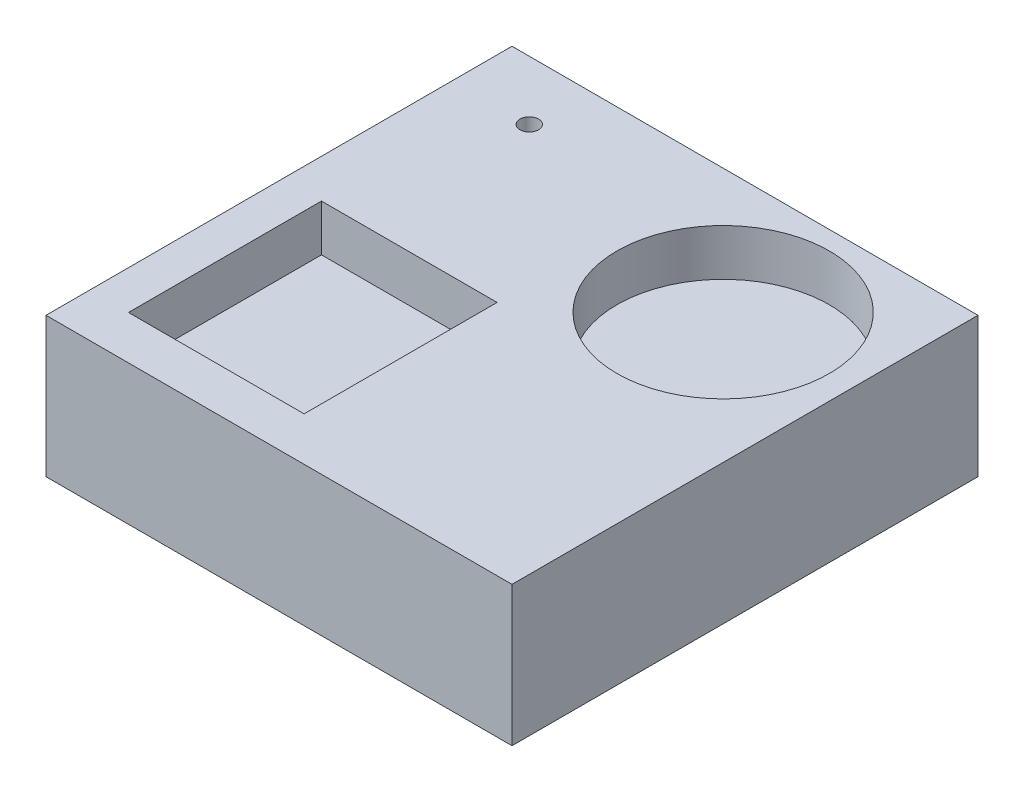
ISO-10303-21;
HEADER;
FILE_DESCRIPTION(('STEP AP214'),'2;1');
FILE_NAME('part.step','',(''),(''),'','','');
FILE_SCHEMA(('AUTOMOTIVE_DESIGN { 1 0 10303 214 1 1 1 1 }'));
ENDSEC;
DATA;
#1=APPLICATION_CONTEXT('core data for automotive mechanical design processes');
#2=APPLICATION_PROTOCOL_DEFINITION('international standard','automotive_design',2000,#1);
#3=PRODUCT_CONTEXT('',#1,'mechanical');
#4=PRODUCT('Part','Part','',(#3));
#5=PRODUCT_RELATED_PRODUCT_CATEGORY('part','',(#4));
#6=PRODUCT_DEFINITION_FORMATION('','',#4);
#7=PRODUCT_DEFINITION_CONTEXT('part definition',#1,'design');
#8=PRODUCT_DEFINITION('design','',#6,#7);
#9=PRODUCT_DEFINITION_SHAPE('','',#8);
#10=(LENGTH_UNIT() NAMED_UNIT(*) SI_UNIT(.MILLI.,.METRE.));
#11=(NAMED_UNIT(*) PLANE_ANGLE_UNIT() SI_UNIT($,.RADIAN.));
#12=(NAMED_UNIT(*) SI_UNIT($,.STERADIAN.) SOLID_ANGLE_UNIT());
#13=UNCERTAINTY_MEASURE_WITH_UNIT(LENGTH_MEASURE(1.E-05),#10,'distance_accuracy_value','');
#14=(GEOMETRIC_REPRESENTATION_CONTEXT(3) GLOBAL_UNCERTAINTY_ASSIGNED_CONTEXT((#13)) GLOBAL_UNIT_ASSIGNED_CONTEXT((#10,
#11,#12)) REPRESENTATION_CONTEXT('',''));
#15=CARTESIAN_POINT('',(0.,0.,0.));
#16=DIRECTION('',(0.,0.,1.));
#17=DIRECTION('',(1.,0.,0.));
#18=AXIS2_PLACEMENT_3D('',#15,#16,#17);
#19=CARTESIAN_POINT('',(0.,30.,0.));
#20=DIRECTION('',(1.,0.,0.));
#21=DIRECTION('',(0.,0.,-1.));
#22=AXIS2_PLACEMENT_3D('',#19,#20,#21);
#23=PLANE('',#22);
#24=DIRECTION('',(0.,0.,1.));
#25=VECTOR('',#24,1.);
#26=CARTESIAN_POINT('',(0.,0.,0.));
#27=LINE('',#26,#25);
#28=CARTESIAN_POINT('',(0.,0.,-100.));
#29=VERTEX_POINT('',#28);
#30=CARTESIAN_POINT('',(0.,0.,0.));
#31=VERTEX_POINT('',#30);
#32=EDGE_CURVE('E176',#29,#31,#27,.T.);
#33=ORIENTED_EDGE('',*,*,#32,.T.);
#34=DIRECTION('',(0.,-1.,0.));
#35=VECTOR('',#34,1.);
#36=CARTESIAN_POINT('',(0.,30.,0.));
#37=LINE('',#36,#35);
#38=CARTESIAN_POINT('',(0.,30.,0.));
#39=VERTEX_POINT('',#38);
#40=EDGE_CURVE('E11',#39,#31,#37,.T.);
#41=ORIENTED_EDGE('',*,*,#40,.F.);
#42=DIRECTION('',(0.,0.,1.));
#43=VECTOR('',#42,1.);
#44=CARTESIAN_POINT('',(0.,30.,0.));
#45=LINE('',#44,#43);
#46=CARTESIAN_POINT('',(0.,30.,-100.));
#47=VERTEX_POINT('',#46);
#48=EDGE_CURVE('E180',#47,#39,#45,.T.);
#49=ORIENTED_EDGE('',*,*,#48,.F.);
#50=DIRECTION('',(0.,-1.,0.));
#51=VECTOR('',#50,1.);
#52=CARTESIAN_POINT('',(0.,30.,-100.));
#53=LINE('',#52,#51);
#54=EDGE_CURVE('E190',#47,#29,#53,.T.);
#55=ORIENTED_EDGE('',*,*,#54,.T.);
#56=EDGE_LOOP('',(#33,#41,#49,#55));
#57=FACE_BOUND('',#56,.T.);
#58=ADVANCED_FACE('F39',(#57),#23,.F.);
#59=CARTESIAN_POINT('',(0.,30.,0.));
#60=DIRECTION('',(0.,0.,-1.));
#61=DIRECTION('',(-1.,0.,0.));
#62=AXIS2_PLACEMENT_3D('',#59,#60,#61);
#63=PLANE('',#62);
#64=DIRECTION('',(1.,0.,0.));
#65=VECTOR('',#64,1.);
#66=CARTESIAN_POINT('',(0.,0.,0.));
#67=LINE('',#66,#65);
#68=CARTESIAN_POINT('',(100.,0.,0.));
#69=VERTEX_POINT('',#68);
#70=EDGE_CURVE('E194',#31,#69,#67,.T.);
#71=ORIENTED_EDGE('',*,*,#70,.T.);
#72=DIRECTION('',(0.,-1.,0.));
#73=VECTOR('',#72,1.);
#74=CARTESIAN_POINT('',(100.,30.,0.));
#75=LINE('',#74,#73);
#76=CARTESIAN_POINT('',(100.,30.,0.));
#77=VERTEX_POINT('',#76);
#78=EDGE_CURVE('E47',#77,#69,#75,.T.);
#79=ORIENTED_EDGE('',*,*,#78,.F.);
#80=DIRECTION('',(1.,0.,0.));
#81=VECTOR('',#80,1.);
#82=CARTESIAN_POINT('',(0.,30.,0.));
#83=LINE('',#82,#81);
#84=EDGE_CURVE('E91',#39,#77,#83,.T.);
#85=ORIENTED_EDGE('',*,*,#84,.F.);
#86=ORIENTED_EDGE('',*,*,#40,.T.);
#87=EDGE_LOOP('',(#71,#79,#85,#86));
#88=FACE_BOUND('',#87,.T.);
#89=ADVANCED_FACE('F229',(#88),#63,.F.);
#90=CARTESIAN_POINT('',(100.,30.,0.));
#91=DIRECTION('',(-1.,0.,0.));
#92=DIRECTION('',(0.,0.,1.));
#93=AXIS2_PLACEMENT_3D('',#90,#91,#92);
#94=PLANE('',#93);
#95=DIRECTION('',(0.,0.,-1.));
#96=VECTOR('',#95,1.);
#97=CARTESIAN_POINT('',(100.,0.,0.));
#98=LINE('',#97,#96);
#99=CARTESIAN_POINT('',(100.,0.,-100.));
#100=VERTEX_POINT('',#99);
#101=EDGE_CURVE('E197',#69,#100,#98,.T.);
#102=ORIENTED_EDGE('',*,*,#101,.T.);
#103=DIRECTION('',(0.,-1.,0.));
#104=VECTOR('',#103,1.);
#105=CARTESIAN_POINT('',(100.,30.,-100.));
#106=LINE('',#105,#104);
#107=CARTESIAN_POINT('',(100.,30.,-100.));
#108=VERTEX_POINT('',#107);
#109=EDGE_CURVE('E204',#108,#100,#106,.T.);
#110=ORIENTED_EDGE('',*,*,#109,.F.);
#111=DIRECTION('',(0.,0.,-1.));
#112=VECTOR('',#111,1.);
#113=CARTESIAN_POINT('',(100.,30.,0.));
#114=LINE('',#113,#112);
#115=EDGE_CURVE('E185',#77,#108,#114,.T.);
#116=ORIENTED_EDGE('',*,*,#115,.F.);
#117=ORIENTED_EDGE('',*,*,#78,.T.);
#118=EDGE_LOOP('',(#102,#110,#116,#117));
#119=FACE_BOUND('',#118,.T.);
#120=ADVANCED_FACE('F211',(#119),#94,.F.);
#121=CARTESIAN_POINT('',(0.,30.,-100.));
#122=DIRECTION('',(0.,0.,1.));
#123=DIRECTION('',(1.,0.,0.));
#124=AXIS2_PLACEMENT_3D('',#121,#122,#123);
#125=PLANE('',#124);
#126=DIRECTION('',(-1.,0.,0.));
#127=VECTOR('',#126,1.);
#128=CARTESIAN_POINT('',(0.,0.,-100.));
#129=LINE('',#128,#127);
#130=EDGE_CURVE('E84',#100,#29,#129,.T.);
#131=ORIENTED_EDGE('',*,*,#130,.T.);
#132=ORIENTED_EDGE('',*,*,#54,.F.);
#133=DIRECTION('',(-1.,0.,0.));
#134=VECTOR('',#133,1.);
#135=CARTESIAN_POINT('',(0.,30.,-100.));
#136=LINE('',#135,#134);
#137=EDGE_CURVE('E63',#108,#47,#136,.T.);
#138=ORIENTED_EDGE('',*,*,#137,.F.);
#139=ORIENTED_EDGE('',*,*,#109,.T.);
#140=EDGE_LOOP('',(#131,#132,#138,#139));
#141=FACE_BOUND('',#140,.T.);
#142=ADVANCED_FACE('F219',(#141),#125,.F.);
#143=CARTESIAN_POINT('',(0.,30.,0.));
#144=DIRECTION('',(0.,-1.,0.));
#145=DIRECTION('',(0.,0.,-1.));
#146=AXIS2_PLACEMENT_3D('',#143,#144,#145);
#147=PLANE('',#146);
#148=DIRECTION('',(1.,0.,0.));
#149=VECTOR('',#148,1.);
#150=CARTESIAN_POINT('',(8.32789443786908,30.,-9.37411485810458));
#151=LINE('',#150,#149);
#152=CARTESIAN_POINT('',(8.32789443786908,30.,-9.37411485810458));
#153=VERTEX_POINT('',#152);
#154=CARTESIAN_POINT('',(46.0113838607228,30.,-9.37411485810458));
#155=VERTEX_POINT('',#154);
#156=EDGE_CURVE('E149',#153,#155,#151,.T.);
#157=ORIENTED_EDGE('',*,*,#156,.F.);
#158=DIRECTION('',(0.,0.,1.));
#159=VECTOR('',#158,1.);
#160=CARTESIAN_POINT('',(8.32789443786908,30.,-50.787427560806));
#161=LINE('',#160,#159);
#162=CARTESIAN_POINT('',(8.32789443786908,30.,-50.787427560806));
#163=VERTEX_POINT('',#162);
#164=EDGE_CURVE('E54',#163,#153,#161,.T.);
#165=ORIENTED_EDGE('',*,*,#164,.F.);
#166=DIRECTION('',(-1.,0.,0.));
#167=VECTOR('',#166,1.);
#168=CARTESIAN_POINT('',(8.32789443786908,30.,-50.787427560806));
#169=LINE('',#168,#167);
#170=CARTESIAN_POINT('',(46.0113838607228,30.,-50.787427560806));
#171=VERTEX_POINT('',#170);
#172=EDGE_CURVE('E136',#171,#163,#169,.T.);
#173=ORIENTED_EDGE('',*,*,#172,.F.);
#174=DIRECTION('',(0.,0.,-1.));
#175=VECTOR('',#174,1.);
#176=CARTESIAN_POINT('',(46.0113838607228,30.,-50.787427560806));
#177=LINE('',#176,#175);
#178=EDGE_CURVE('E140',#155,#171,#177,.T.);
#179=ORIENTED_EDGE('',*,*,#178,.F.);
#180=EDGE_LOOP('',(#157,#165,#173,#179));
#181=FACE_BOUND('',#180,.T.);
#182=CARTESIAN_POINT('',(72.0846402277573,30.,-73.2251707576097));
#183=DIRECTION('',(0.,1.,0.));
#184=DIRECTION('',(0.,0.,1.));
#185=AXIS2_PLACEMENT_3D('',#182,#183,#184);
#186=CIRCLE('',#185,22.7899638797003);
#187=CARTESIAN_POINT('',(72.0846402277573,30.,-50.4352068779094));
#188=VERTEX_POINT('',#187);
#189=EDGE_CURVE('E168',#188,#188,#186,.T.);
#190=ORIENTED_EDGE('',*,*,#189,.F.);
#191=EDGE_LOOP('',(#190));
#192=FACE_BOUND('',#191,.T.);
#193=CARTESIAN_POINT('',(16.3843135452169,30.,-87.3231980243077));
#194=DIRECTION('',(0.,1.,0.));
#195=DIRECTION('',(0.,0.,1.));
#196=AXIS2_PLACEMENT_3D('',#193,#194,#195);
#197=CIRCLE('',#196,2.);
#198=CARTESIAN_POINT('',(16.3843135452169,30.,-85.3231980243077));
#199=VERTEX_POINT('',#198);
#200=EDGE_CURVE('E159',#199,#199,#197,.T.);
#201=ORIENTED_EDGE('',*,*,#200,.F.);
#202=EDGE_LOOP('',(#201));
#203=FACE_BOUND('',#202,.T.);
#204=ORIENTED_EDGE('',*,*,#48,.T.);
#205=ORIENTED_EDGE('',*,*,#84,.T.);
#206=ORIENTED_EDGE('',*,*,#115,.T.);
#207=ORIENTED_EDGE('',*,*,#137,.T.);
#208=EDGE_LOOP('',(#204,#205,#206,#207));
#209=FACE_BOUND('',#208,.T.);
#210=ADVANCED_FACE('F221',(#181,#192,#203,#209),#147,.F.);
#211=CARTESIAN_POINT('',(0.,0.,0.));
#212=DIRECTION('',(0.,-1.,0.));
#213=DIRECTION('',(0.,0.,-1.));
#214=AXIS2_PLACEMENT_3D('',#211,#212,#213);
#215=PLANE('',#214);
#216=CARTESIAN_POINT('',(16.3843135452169,0.,-87.3231980243077));
#217=DIRECTION('',(0.,1.,0.));
#218=DIRECTION('',(0.,0.,1.));
#219=AXIS2_PLACEMENT_3D('',#216,#217,#218);
#220=CIRCLE('',#219,2.);
#221=CARTESIAN_POINT('',(16.3843135452169,0.,-85.3231980243077));
#222=VERTEX_POINT('',#221);
#223=EDGE_CURVE('E172',#222,#222,#220,.T.);
#224=ORIENTED_EDGE('',*,*,#223,.T.);
#225=EDGE_LOOP('',(#224));
#226=FACE_BOUND('',#225,.T.);
#227=ORIENTED_EDGE('',*,*,#32,.F.);
#228=ORIENTED_EDGE('',*,*,#130,.F.);
#229=ORIENTED_EDGE('',*,*,#101,.F.);
#230=ORIENTED_EDGE('',*,*,#70,.F.);
#231=EDGE_LOOP('',(#227,#228,#229,#230));
#232=FACE_BOUND('',#231,.T.);
#233=ADVANCED_FACE('F215',(#226,#232),#215,.T.);
#234=CARTESIAN_POINT('',(16.3843135452169,0.,-87.3231980243077));
#235=DIRECTION('',(0.,1.,0.));
#236=DIRECTION('',(0.,0.,1.));
#237=AXIS2_PLACEMENT_3D('',#234,#235,#236);
#238=CYLINDRICAL_SURFACE('',#237,2.);
#239=ORIENTED_EDGE('',*,*,#223,.F.);
#240=EDGE_LOOP('',(#239));
#241=FACE_BOUND('',#240,.T.);
#242=ORIENTED_EDGE('',*,*,#200,.T.);
#243=EDGE_LOOP('',(#242));
#244=FACE_BOUND('',#243,.T.);
#245=ADVANCED_FACE('F256',(#241,#244),#238,.F.);
#246=CARTESIAN_POINT('',(72.0846402277573,20.,-73.2251707576097));
#247=DIRECTION('',(0.,1.,0.));
#248=DIRECTION('',(0.,0.,1.));
#249=AXIS2_PLACEMENT_3D('',#246,#247,#248);
#250=CYLINDRICAL_SURFACE('',#249,22.7899638797003);
#251=CARTESIAN_POINT('',(72.0846402277573,20.,-73.2251707576097));
#252=DIRECTION('',(0.,1.,0.));
#253=DIRECTION('',(0.,0.,1.));
#254=AXIS2_PLACEMENT_3D('',#251,#252,#253);
#255=CIRCLE('',#254,22.7899638797003);
#256=CARTESIAN_POINT('',(72.0846402277573,20.,-50.4352068779094));
#257=VERTEX_POINT('',#256);
#258=EDGE_CURVE('E150',#257,#257,#255,.T.);
#259=ORIENTED_EDGE('',*,*,#258,.F.);
#260=EDGE_LOOP('',(#259));
#261=FACE_BOUND('',#260,.T.);
#262=ORIENTED_EDGE('',*,*,#189,.T.);
#263=EDGE_LOOP('',(#262));
#264=FACE_BOUND('',#263,.T.);
#265=ADVANCED_FACE('F265',(#261,#264),#250,.F.);
#266=CARTESIAN_POINT('',(72.0846402277573,20.,-73.2251707576097));
#267=DIRECTION('',(0.,1.,0.));
#268=DIRECTION('',(0.,0.,1.));
#269=AXIS2_PLACEMENT_3D('',#266,#267,#268);
#270=PLANE('',#269);
#271=ORIENTED_EDGE('',*,*,#258,.T.);
#272=EDGE_LOOP('',(#271));
#273=FACE_BOUND('',#272,.T.);
#274=ADVANCED_FACE('F280',(#273),#270,.T.);
#275=CARTESIAN_POINT('',(8.32789443786908,20.,-50.787427560806));
#276=DIRECTION('',(-1.,0.,0.));
#277=DIRECTION('',(0.,0.,1.));
#278=AXIS2_PLACEMENT_3D('',#275,#276,#277);
#279=PLANE('',#278);
#280=ORIENTED_EDGE('',*,*,#164,.T.);
#281=DIRECTION('',(0.,1.,0.));
#282=VECTOR('',#281,1.);
#283=CARTESIAN_POINT('',(8.32789443786908,20.,-9.37411485810458));
#284=LINE('',#283,#282);
#285=CARTESIAN_POINT('',(8.32789443786908,20.,-9.37411485810458));
#286=VERTEX_POINT('',#285);
#287=EDGE_CURVE('E111',#286,#153,#284,.T.);
#288=ORIENTED_EDGE('',*,*,#287,.F.);
#289=DIRECTION('',(0.,0.,1.));
#290=VECTOR('',#289,1.);
#291=CARTESIAN_POINT('',(8.32789443786908,20.,-50.787427560806));
#292=LINE('',#291,#290);
#293=CARTESIAN_POINT('',(8.32789443786908,20.,-50.787427560806));
#294=VERTEX_POINT('',#293);
#295=EDGE_CURVE('E115',#294,#286,#292,.T.);
#296=ORIENTED_EDGE('',*,*,#295,.F.);
#297=DIRECTION('',(0.,1.,0.));
#298=VECTOR('',#297,1.);
#299=CARTESIAN_POINT('',(8.32789443786908,20.,-50.787427560806));
#300=LINE('',#299,#298);
#301=EDGE_CURVE('E156',#294,#163,#300,.T.);
#302=ORIENTED_EDGE('',*,*,#301,.T.);
#303=EDGE_LOOP('',(#280,#288,#296,#302));
#304=FACE_BOUND('',#303,.T.);
#305=ADVANCED_FACE('F113',(#304),#279,.F.);
#306=CARTESIAN_POINT('',(8.32789443786908,20.,-50.787427560806));
#307=DIRECTION('',(0.,0.,-1.));
#308=DIRECTION('',(-1.,0.,0.));
#309=AXIS2_PLACEMENT_3D('',#306,#307,#308);
#310=PLANE('',#309);
#311=ORIENTED_EDGE('',*,*,#172,.T.);
#312=ORIENTED_EDGE('',*,*,#301,.F.);
#313=DIRECTION('',(-1.,0.,0.));
#314=VECTOR('',#313,1.);
#315=CARTESIAN_POINT('',(8.32789443786908,20.,-50.787427560806));
#316=LINE('',#315,#314);
#317=CARTESIAN_POINT('',(46.0113838607228,20.,-50.787427560806));
#318=VERTEX_POINT('',#317);
#319=EDGE_CURVE('E122',#318,#294,#316,.T.);
#320=ORIENTED_EDGE('',*,*,#319,.F.);
#321=DIRECTION('',(0.,1.,0.));
#322=VECTOR('',#321,1.);
#323=CARTESIAN_POINT('',(46.0113838607228,20.,-50.787427560806));
#324=LINE('',#323,#322);
#325=EDGE_CURVE('E160',#318,#171,#324,.T.);
#326=ORIENTED_EDGE('',*,*,#325,.T.);
#327=EDGE_LOOP('',(#311,#312,#320,#326));
#328=FACE_BOUND('',#327,.T.);
#329=ADVANCED_FACE('F299',(#328),#310,.F.);
#330=CARTESIAN_POINT('',(46.0113838607228,20.,-50.787427560806));
#331=DIRECTION('',(1.,0.,0.));
#332=DIRECTION('',(0.,0.,-1.));
#333=AXIS2_PLACEMENT_3D('',#330,#331,#332);
#334=PLANE('',#333);
#335=ORIENTED_EDGE('',*,*,#178,.T.);
#336=ORIENTED_EDGE('',*,*,#325,.F.);
#337=DIRECTION('',(0.,0.,-1.));
#338=VECTOR('',#337,1.);
#339=CARTESIAN_POINT('',(46.0113838607228,20.,-50.787427560806));
#340=LINE('',#339,#338);
#341=CARTESIAN_POINT('',(46.0113838607228,20.,-9.37411485810458));
#342=VERTEX_POINT('',#341);
#343=EDGE_CURVE('E131',#342,#318,#340,.T.);
#344=ORIENTED_EDGE('',*,*,#343,.F.);
#345=DIRECTION('',(0.,1.,0.));
#346=VECTOR('',#345,1.);
#347=CARTESIAN_POINT('',(46.0113838607228,20.,-9.37411485810458));
#348=LINE('',#347,#346);
#349=EDGE_CURVE('E121',#342,#155,#348,.T.);
#350=ORIENTED_EDGE('',*,*,#349,.T.);
#351=EDGE_LOOP('',(#335,#336,#344,#350));
#352=FACE_BOUND('',#351,.T.);
#353=ADVANCED_FACE('F308',(#352),#334,.F.);
#354=CARTESIAN_POINT('',(8.32789443786908,20.,-9.37411485810458));
#355=DIRECTION('',(0.,0.,1.));
#356=DIRECTION('',(1.,0.,0.));
#357=AXIS2_PLACEMENT_3D('',#354,#355,#356);
#358=PLANE('',#357);
#359=ORIENTED_EDGE('',*,*,#156,.T.);
#360=ORIENTED_EDGE('',*,*,#349,.F.);
#361=DIRECTION('',(1.,0.,0.));
#362=VECTOR('',#361,1.);
#363=CARTESIAN_POINT('',(8.32789443786908,20.,-9.37411485810458));
#364=LINE('',#363,#362);
#365=EDGE_CURVE('E125',#286,#342,#364,.T.);
#366=ORIENTED_EDGE('',*,*,#365,.F.);
#367=ORIENTED_EDGE('',*,*,#287,.T.);
#368=EDGE_LOOP('',(#359,#360,#366,#367));
#369=FACE_BOUND('',#368,.T.);
#370=ADVANCED_FACE('F126',(#369),#358,.F.);
#371=CARTESIAN_POINT('',(0.,20.,0.));
#372=DIRECTION('',(0.,1.,0.));
#373=DIRECTION('',(0.,0.,1.));
#374=AXIS2_PLACEMENT_3D('',#371,#372,#373);
#375=PLANE('',#374);
#376=ORIENTED_EDGE('',*,*,#295,.T.);
#377=ORIENTED_EDGE('',*,*,#365,.T.);
#378=ORIENTED_EDGE('',*,*,#343,.T.);
#379=ORIENTED_EDGE('',*,*,#319,.T.);
#380=EDGE_LOOP('',(#376,#377,#378,#379));
#381=FACE_BOUND('',#380,.T.);
#382=ADVANCED_FACE('F133',(#381),#375,.T.);
#383=CLOSED_SHELL('',(#58,#89,#120,#142,#210,#233,#245,#265,#274,#305,#329,#353,#370,#382));
#384=MANIFOLD_SOLID_BREP('B2',#383);
#385=ADVANCED_BREP_SHAPE_REPRESENTATION('',(#18,#384),#14);
#386=SHAPE_DEFINITION_REPRESENTATION(#9,#385);
ENDSEC;
END-ISO-10303-21;
